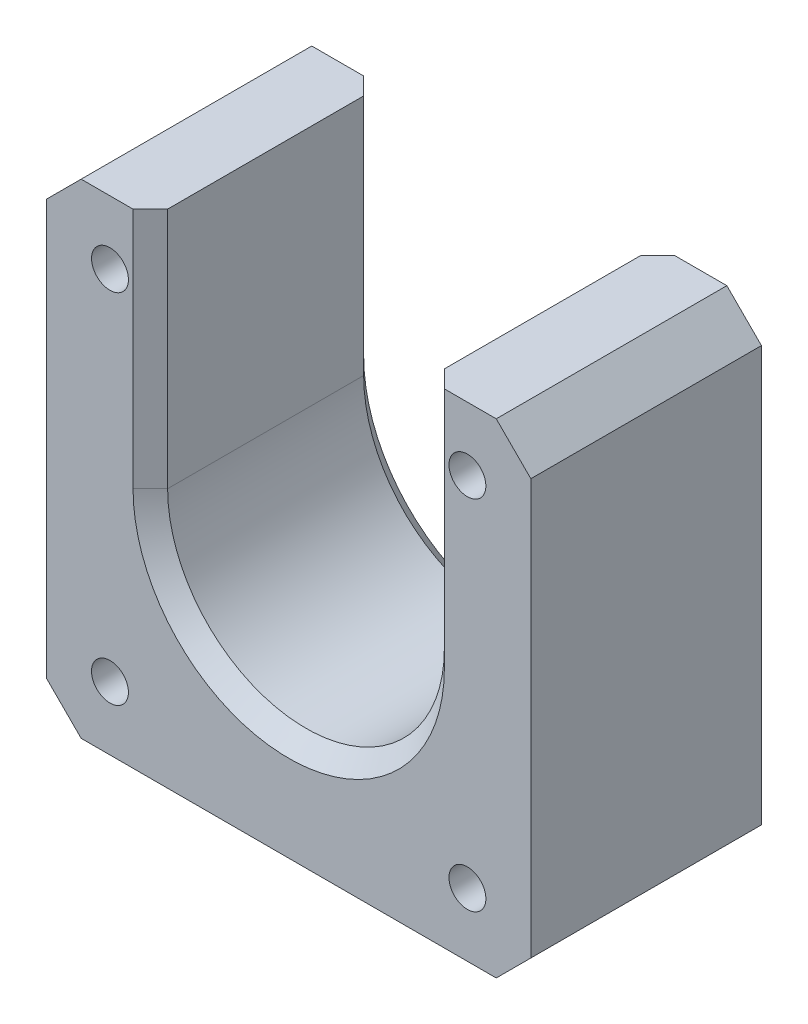
ISO-10303-21;
HEADER;
FILE_DESCRIPTION(('STEP AP214'),'2;1');
FILE_NAME('part.step','',(''),(''),'','','');
FILE_SCHEMA(('AUTOMOTIVE_DESIGN { 1 0 10303 214 1 1 1 1 }'));
ENDSEC;
DATA;
#1=APPLICATION_CONTEXT('core data for automotive mechanical design processes');
#2=APPLICATION_PROTOCOL_DEFINITION('international standard','automotive_design',2000,#1);
#3=PRODUCT_CONTEXT('',#1,'mechanical');
#4=PRODUCT('Part','Part','',(#3));
#5=PRODUCT_RELATED_PRODUCT_CATEGORY('part','',(#4));
#6=PRODUCT_DEFINITION_FORMATION('','',#4);
#7=PRODUCT_DEFINITION_CONTEXT('part definition',#1,'design');
#8=PRODUCT_DEFINITION('design','',#6,#7);
#9=PRODUCT_DEFINITION_SHAPE('','',#8);
#10=(LENGTH_UNIT() NAMED_UNIT(*) SI_UNIT(.MILLI.,.METRE.));
#11=(NAMED_UNIT(*) PLANE_ANGLE_UNIT() SI_UNIT($,.RADIAN.));
#12=(NAMED_UNIT(*) SI_UNIT($,.STERADIAN.) SOLID_ANGLE_UNIT());
#13=UNCERTAINTY_MEASURE_WITH_UNIT(LENGTH_MEASURE(1.E-05),#10,'distance_accuracy_value','');
#14=(GEOMETRIC_REPRESENTATION_CONTEXT(3) GLOBAL_UNCERTAINTY_ASSIGNED_CONTEXT((#13)) GLOBAL_UNIT_ASSIGNED_CONTEXT((#10,
#11,#12)) REPRESENTATION_CONTEXT('',''));
#15=CARTESIAN_POINT('',(0.,0.,0.));
#16=DIRECTION('',(0.,0.,1.));
#17=DIRECTION('',(1.,0.,0.));
#18=AXIS2_PLACEMENT_3D('',#15,#16,#17);
#19=CARTESIAN_POINT('',(-18.,-21.,20.));
#20=DIRECTION('',(0.707106781186547,0.707106781186548,0.));
#21=DIRECTION('',(0.,0.,-1.));
#22=AXIS2_PLACEMENT_3D('',#19,#20,#21);
#23=PLANE('',#22);
#24=DIRECTION('',(0.,0.,-1.));
#25=VECTOR('',#24,1.);
#26=CARTESIAN_POINT('',(-18.,-21.,20.));
#27=LINE('',#26,#25);
#28=CARTESIAN_POINT('',(-18.,-21.,20.));
#29=VERTEX_POINT('',#28);
#30=CARTESIAN_POINT('',(-18.,-21.,0.));
#31=VERTEX_POINT('',#30);
#32=EDGE_CURVE('E234',#29,#31,#27,.T.);
#33=ORIENTED_EDGE('',*,*,#32,.F.);
#34=DIRECTION('',(-0.707106781186548,0.707106781186547,0.));
#35=VECTOR('',#34,1.);
#36=CARTESIAN_POINT('',(-19.5,-19.5,20.));
#37=LINE('',#36,#35);
#38=CARTESIAN_POINT('',(-21.,-18.,20.));
#39=VERTEX_POINT('',#38);
#40=EDGE_CURVE('E242',#39,#29,#37,.F.);
#41=ORIENTED_EDGE('',*,*,#40,.F.);
#42=DIRECTION('',(0.,0.,1.));
#43=VECTOR('',#42,1.);
#44=CARTESIAN_POINT('',(-21.,-18.,20.));
#45=LINE('',#44,#43);
#46=CARTESIAN_POINT('',(-21.,-18.,0.));
#47=VERTEX_POINT('',#46);
#48=EDGE_CURVE('E238',#47,#39,#45,.T.);
#49=ORIENTED_EDGE('',*,*,#48,.F.);
#50=DIRECTION('',(0.707106781186548,-0.707106781186547,0.));
#51=VECTOR('',#50,1.);
#52=CARTESIAN_POINT('',(-18.,-21.,0.));
#53=LINE('',#52,#51);
#54=EDGE_CURVE('E245',#31,#47,#53,.F.);
#55=ORIENTED_EDGE('',*,*,#54,.F.);
#56=EDGE_LOOP('',(#33,#41,#49,#55));
#57=FACE_BOUND('',#56,.T.);
#58=ADVANCED_FACE('F51',(#57),#23,.F.);
#59=CARTESIAN_POINT('',(21.,-18.,20.));
#60=DIRECTION('',(-0.707106781186547,0.707106781186548,0.));
#61=DIRECTION('',(0.,0.,-1.));
#62=AXIS2_PLACEMENT_3D('',#59,#60,#61);
#63=PLANE('',#62);
#64=DIRECTION('',(0.,0.,-1.));
#65=VECTOR('',#64,1.);
#66=CARTESIAN_POINT('',(21.,-18.,20.));
#67=LINE('',#66,#65);
#68=CARTESIAN_POINT('',(21.,-18.,20.));
#69=VERTEX_POINT('',#68);
#70=CARTESIAN_POINT('',(21.,-18.,0.));
#71=VERTEX_POINT('',#70);
#72=EDGE_CURVE('E219',#69,#71,#67,.T.);
#73=ORIENTED_EDGE('',*,*,#72,.F.);
#74=DIRECTION('',(-0.707106781186548,-0.707106781186547,0.));
#75=VECTOR('',#74,1.);
#76=CARTESIAN_POINT('',(19.5,-19.5,20.));
#77=LINE('',#76,#75);
#78=CARTESIAN_POINT('',(18.,-21.,20.));
#79=VERTEX_POINT('',#78);
#80=EDGE_CURVE('E227',#79,#69,#77,.F.);
#81=ORIENTED_EDGE('',*,*,#80,.F.);
#82=DIRECTION('',(0.,0.,1.));
#83=VECTOR('',#82,1.);
#84=CARTESIAN_POINT('',(18.,-21.,20.));
#85=LINE('',#84,#83);
#86=CARTESIAN_POINT('',(18.,-21.,0.));
#87=VERTEX_POINT('',#86);
#88=EDGE_CURVE('E223',#87,#79,#85,.T.);
#89=ORIENTED_EDGE('',*,*,#88,.F.);
#90=DIRECTION('',(0.707106781186548,0.707106781186547,0.));
#91=VECTOR('',#90,1.);
#92=CARTESIAN_POINT('',(21.,-18.,0.));
#93=LINE('',#92,#91);
#94=EDGE_CURVE('E230',#71,#87,#93,.F.);
#95=ORIENTED_EDGE('',*,*,#94,.F.);
#96=EDGE_LOOP('',(#73,#81,#89,#95));
#97=FACE_BOUND('',#96,.T.);
#98=ADVANCED_FACE('F400',(#97),#63,.F.);
#99=CARTESIAN_POINT('',(18.,21.,20.));
#100=DIRECTION('',(-0.707106781186547,-0.707106781186548,0.));
#101=DIRECTION('',(0.,0.,-1.));
#102=AXIS2_PLACEMENT_3D('',#99,#100,#101);
#103=PLANE('',#102);
#104=DIRECTION('',(0.,0.,-1.));
#105=VECTOR('',#104,1.);
#106=CARTESIAN_POINT('',(18.,21.,20.));
#107=LINE('',#106,#105);
#108=CARTESIAN_POINT('',(18.,21.,20.));
#109=VERTEX_POINT('',#108);
#110=CARTESIAN_POINT('',(18.,21.,0.));
#111=VERTEX_POINT('',#110);
#112=EDGE_CURVE('E186',#109,#111,#107,.T.);
#113=ORIENTED_EDGE('',*,*,#112,.F.);
#114=DIRECTION('',(0.707106781186548,-0.707106781186547,0.));
#115=VECTOR('',#114,1.);
#116=CARTESIAN_POINT('',(19.5,19.5,20.));
#117=LINE('',#116,#115);
#118=CARTESIAN_POINT('',(21.,18.,20.));
#119=VERTEX_POINT('',#118);
#120=EDGE_CURVE('E212',#119,#109,#117,.F.);
#121=ORIENTED_EDGE('',*,*,#120,.F.);
#122=DIRECTION('',(0.,0.,1.));
#123=VECTOR('',#122,1.);
#124=CARTESIAN_POINT('',(21.,18.,20.));
#125=LINE('',#124,#123);
#126=CARTESIAN_POINT('',(21.,18.,0.));
#127=VERTEX_POINT('',#126);
#128=EDGE_CURVE('E208',#127,#119,#125,.T.);
#129=ORIENTED_EDGE('',*,*,#128,.F.);
#130=DIRECTION('',(-0.707106781186548,0.707106781186547,0.));
#131=VECTOR('',#130,1.);
#132=CARTESIAN_POINT('',(18.,21.,0.));
#133=LINE('',#132,#131);
#134=EDGE_CURVE('E215',#111,#127,#133,.F.);
#135=ORIENTED_EDGE('',*,*,#134,.F.);
#136=EDGE_LOOP('',(#113,#121,#129,#135));
#137=FACE_BOUND('',#136,.T.);
#138=ADVANCED_FACE('F406',(#137),#103,.F.);
#139=CARTESIAN_POINT('',(-18.,21.,20.));
#140=DIRECTION('',(0.707106781186547,-0.707106781186548,0.));
#141=DIRECTION('',(0.,0.,1.));
#142=AXIS2_PLACEMENT_3D('',#139,#140,#141);
#143=PLANE('',#142);
#144=DIRECTION('',(0.,0.,1.));
#145=VECTOR('',#144,1.);
#146=CARTESIAN_POINT('',(-18.,21.,20.));
#147=LINE('',#146,#145);
#148=CARTESIAN_POINT('',(-18.,21.,0.));
#149=VERTEX_POINT('',#148);
#150=CARTESIAN_POINT('',(-18.,21.,20.));
#151=VERTEX_POINT('',#150);
#152=EDGE_CURVE('E181',#149,#151,#147,.T.);
#153=ORIENTED_EDGE('',*,*,#152,.F.);
#154=DIRECTION('',(-0.707106781186548,-0.707106781186547,0.));
#155=VECTOR('',#154,1.);
#156=CARTESIAN_POINT('',(-18.,21.,0.));
#157=LINE('',#156,#155);
#158=CARTESIAN_POINT('',(-21.,18.,0.));
#159=VERTEX_POINT('',#158);
#160=EDGE_CURVE('E187',#159,#149,#157,.F.);
#161=ORIENTED_EDGE('',*,*,#160,.F.);
#162=DIRECTION('',(0.,0.,-1.));
#163=VECTOR('',#162,1.);
#164=CARTESIAN_POINT('',(-21.,18.,20.));
#165=LINE('',#164,#163);
#166=CARTESIAN_POINT('',(-21.,18.,20.));
#167=VERTEX_POINT('',#166);
#168=EDGE_CURVE('E183',#167,#159,#165,.T.);
#169=ORIENTED_EDGE('',*,*,#168,.F.);
#170=DIRECTION('',(0.707106781186548,0.707106781186547,0.));
#171=VECTOR('',#170,1.);
#172=CARTESIAN_POINT('',(-19.5,19.5,20.));
#173=LINE('',#172,#171);
#174=EDGE_CURVE('E169',#151,#167,#173,.F.);
#175=ORIENTED_EDGE('',*,*,#174,.F.);
#176=EDGE_LOOP('',(#153,#161,#169,#175));
#177=FACE_BOUND('',#176,.T.);
#178=ADVANCED_FACE('F180',(#177),#143,.F.);
#179=CARTESIAN_POINT('',(-21.,21.,20.));
#180=DIRECTION('',(0.,-1.,0.));
#181=DIRECTION('',(0.,0.,-1.));
#182=AXIS2_PLACEMENT_3D('',#179,#180,#181);
#183=PLANE('',#182);
#184=DIRECTION('',(0.,0.,1.));
#185=VECTOR('',#184,1.);
#186=CARTESIAN_POINT('',(-12.,21.,-10.));
#187=LINE('',#186,#185);
#188=CARTESIAN_POINT('',(-12.,21.,1.5));
#189=VERTEX_POINT('',#188);
#190=CARTESIAN_POINT('',(-12.,21.,18.5));
#191=VERTEX_POINT('',#190);
#192=EDGE_CURVE('E327',#189,#191,#187,.T.);
#193=ORIENTED_EDGE('',*,*,#192,.F.);
#194=DIRECTION('',(0.707106781186546,0.,0.707106781186549));
#195=VECTOR('',#194,1.);
#196=CARTESIAN_POINT('',(-13.5,21.,0.));
#197=LINE('',#196,#195);
#198=CARTESIAN_POINT('',(-13.5,21.,0.));
#199=VERTEX_POINT('',#198);
#200=EDGE_CURVE('E268',#189,#199,#197,.F.);
#201=ORIENTED_EDGE('',*,*,#200,.T.);
#202=DIRECTION('',(-1.,0.,0.));
#203=VECTOR('',#202,1.);
#204=CARTESIAN_POINT('',(-21.,21.,0.));
#205=LINE('',#204,#203);
#206=EDGE_CURVE('E192',#199,#149,#205,.T.);
#207=ORIENTED_EDGE('',*,*,#206,.T.);
#208=ORIENTED_EDGE('',*,*,#152,.T.);
#209=DIRECTION('',(-1.,0.,0.));
#210=VECTOR('',#209,1.);
#211=CARTESIAN_POINT('',(-21.,21.,20.));
#212=LINE('',#211,#210);
#213=CARTESIAN_POINT('',(-13.5,21.,20.));
#214=VERTEX_POINT('',#213);
#215=EDGE_CURVE('E164',#214,#151,#212,.T.);
#216=ORIENTED_EDGE('',*,*,#215,.F.);
#217=DIRECTION('',(0.70710678118655,0.,-0.707106781186546));
#218=VECTOR('',#217,1.);
#219=CARTESIAN_POINT('',(-12.,21.,18.5));
#220=LINE('',#219,#218);
#221=EDGE_CURVE('E265',#214,#191,#220,.T.);
#222=ORIENTED_EDGE('',*,*,#221,.T.);
#223=EDGE_LOOP('',(#193,#201,#207,#208,#216,#222));
#224=FACE_BOUND('',#223,.T.);
#225=ADVANCED_FACE('F190',(#224),#183,.F.);
#226=CARTESIAN_POINT('',(-21.,21.,20.));
#227=DIRECTION('',(1.,0.,0.));
#228=DIRECTION('',(0.,0.,-1.));
#229=AXIS2_PLACEMENT_3D('',#226,#227,#228);
#230=PLANE('',#229);
#231=DIRECTION('',(0.,-1.,0.));
#232=VECTOR('',#231,1.);
#233=CARTESIAN_POINT('',(-21.,21.,0.));
#234=LINE('',#233,#232);
#235=EDGE_CURVE('E352',#159,#47,#234,.T.);
#236=ORIENTED_EDGE('',*,*,#235,.T.);
#237=ORIENTED_EDGE('',*,*,#48,.T.);
#238=DIRECTION('',(0.,-1.,0.));
#239=VECTOR('',#238,1.);
#240=CARTESIAN_POINT('',(-21.,21.,20.));
#241=LINE('',#240,#239);
#242=EDGE_CURVE('E343',#167,#39,#241,.T.);
#243=ORIENTED_EDGE('',*,*,#242,.F.);
#244=ORIENTED_EDGE('',*,*,#168,.T.);
#245=EDGE_LOOP('',(#236,#237,#243,#244));
#246=FACE_BOUND('',#245,.T.);
#247=ADVANCED_FACE('F519',(#246),#230,.F.);
#248=CARTESIAN_POINT('',(-21.,-21.,20.));
#249=DIRECTION('',(0.,1.,0.));
#250=DIRECTION('',(0.,0.,1.));
#251=AXIS2_PLACEMENT_3D('',#248,#249,#250);
#252=PLANE('',#251);
#253=DIRECTION('',(1.,0.,0.));
#254=VECTOR('',#253,1.);
#255=CARTESIAN_POINT('',(-21.,-21.,20.));
#256=LINE('',#255,#254);
#257=EDGE_CURVE('E346',#29,#79,#256,.T.);
#258=ORIENTED_EDGE('',*,*,#257,.F.);
#259=ORIENTED_EDGE('',*,*,#32,.T.);
#260=DIRECTION('',(1.,0.,0.));
#261=VECTOR('',#260,1.);
#262=CARTESIAN_POINT('',(-21.,-21.,0.));
#263=LINE('',#262,#261);
#264=EDGE_CURVE('E356',#31,#87,#263,.T.);
#265=ORIENTED_EDGE('',*,*,#264,.T.);
#266=ORIENTED_EDGE('',*,*,#88,.T.);
#267=EDGE_LOOP('',(#258,#259,#265,#266));
#268=FACE_BOUND('',#267,.T.);
#269=ADVANCED_FACE('F526',(#268),#252,.F.);
#270=CARTESIAN_POINT('',(21.,21.,20.));
#271=DIRECTION('',(-1.,0.,0.));
#272=DIRECTION('',(0.,0.,1.));
#273=AXIS2_PLACEMENT_3D('',#270,#271,#272);
#274=PLANE('',#273);
#275=DIRECTION('',(0.,1.,0.));
#276=VECTOR('',#275,1.);
#277=CARTESIAN_POINT('',(21.,21.,20.));
#278=LINE('',#277,#276);
#279=EDGE_CURVE('E176',#69,#119,#278,.T.);
#280=ORIENTED_EDGE('',*,*,#279,.F.);
#281=ORIENTED_EDGE('',*,*,#72,.T.);
#282=DIRECTION('',(0.,1.,0.));
#283=VECTOR('',#282,1.);
#284=CARTESIAN_POINT('',(21.,21.,0.));
#285=LINE('',#284,#283);
#286=EDGE_CURVE('E359',#71,#127,#285,.T.);
#287=ORIENTED_EDGE('',*,*,#286,.T.);
#288=ORIENTED_EDGE('',*,*,#128,.T.);
#289=EDGE_LOOP('',(#280,#281,#287,#288));
#290=FACE_BOUND('',#289,.T.);
#291=ADVANCED_FACE('F509',(#290),#274,.F.);
#292=CARTESIAN_POINT('',(13.5,21.,0.));
#293=VERTEX_POINT('',#292);
#294=EDGE_CURVE('E347',#111,#293,#205,.T.);
#295=ORIENTED_EDGE('',*,*,#294,.T.);
#296=DIRECTION('',(0.707106781186546,0.,-0.707106781186549));
#297=VECTOR('',#296,1.);
#298=CARTESIAN_POINT('',(13.5,21.,0.));
#299=LINE('',#298,#297);
#300=CARTESIAN_POINT('',(12.,21.,1.5));
#301=VERTEX_POINT('',#300);
#302=EDGE_CURVE('E274',#293,#301,#299,.F.);
#303=ORIENTED_EDGE('',*,*,#302,.T.);
#304=DIRECTION('',(0.,0.,1.));
#305=VECTOR('',#304,1.);
#306=CARTESIAN_POINT('',(12.,21.,-10.));
#307=LINE('',#306,#305);
#308=CARTESIAN_POINT('',(12.,21.,18.5));
#309=VERTEX_POINT('',#308);
#310=EDGE_CURVE('E318',#301,#309,#307,.T.);
#311=ORIENTED_EDGE('',*,*,#310,.T.);
#312=DIRECTION('',(0.70710678118655,0.,0.707106781186546));
#313=VECTOR('',#312,1.);
#314=CARTESIAN_POINT('',(12.,21.,18.5));
#315=LINE('',#314,#313);
#316=CARTESIAN_POINT('',(13.5,21.,20.));
#317=VERTEX_POINT('',#316);
#318=EDGE_CURVE('E271',#309,#317,#315,.T.);
#319=ORIENTED_EDGE('',*,*,#318,.T.);
#320=EDGE_CURVE('E175',#109,#317,#212,.T.);
#321=ORIENTED_EDGE('',*,*,#320,.F.);
#322=ORIENTED_EDGE('',*,*,#112,.T.);
#323=EDGE_LOOP('',(#295,#303,#311,#319,#321,#322));
#324=FACE_BOUND('',#323,.T.);
#325=ADVANCED_FACE('F323',(#324),#183,.F.);
#326=CARTESIAN_POINT('',(0.,0.,20.));
#327=DIRECTION('',(0.,0.,1.));
#328=DIRECTION('',(1.,0.,0.));
#329=AXIS2_PLACEMENT_3D('',#326,#327,#328);
#330=PLANE('',#329);
#331=CARTESIAN_POINT('',(0.,0.,20.));
#332=DIRECTION('',(0.,0.,1.));
#333=DIRECTION('',(1.,0.,0.));
#334=AXIS2_PLACEMENT_3D('',#331,#332,#333);
#335=CIRCLE('',#334,13.5);
#336=CARTESIAN_POINT('',(13.5,0.,20.));
#337=VERTEX_POINT('',#336);
#338=CARTESIAN_POINT('',(-13.5,0.,20.));
#339=VERTEX_POINT('',#338);
#340=EDGE_CURVE('E69',#337,#339,#335,.F.);
#341=ORIENTED_EDGE('',*,*,#340,.T.);
#342=DIRECTION('',(0.,1.,0.));
#343=VECTOR('',#342,1.);
#344=CARTESIAN_POINT('',(-13.5,21.,20.));
#345=LINE('',#344,#343);
#346=EDGE_CURVE('E13',#339,#214,#345,.T.);
#347=ORIENTED_EDGE('',*,*,#346,.T.);
#348=ORIENTED_EDGE('',*,*,#215,.T.);
#349=ORIENTED_EDGE('',*,*,#174,.T.);
#350=ORIENTED_EDGE('',*,*,#242,.T.);
#351=ORIENTED_EDGE('',*,*,#40,.T.);
#352=ORIENTED_EDGE('',*,*,#257,.T.);
#353=ORIENTED_EDGE('',*,*,#80,.T.);
#354=ORIENTED_EDGE('',*,*,#279,.T.);
#355=ORIENTED_EDGE('',*,*,#120,.T.);
#356=ORIENTED_EDGE('',*,*,#320,.T.);
#357=DIRECTION('',(0.,-1.,0.));
#358=VECTOR('',#357,1.);
#359=CARTESIAN_POINT('',(13.5,0.,20.));
#360=LINE('',#359,#358);
#361=EDGE_CURVE('E62',#317,#337,#360,.T.);
#362=ORIENTED_EDGE('',*,*,#361,.T.);
#363=EDGE_LOOP('',(#341,#347,#348,#349,#350,#351,#352,#353,#354,#355,#356,#362));
#364=FACE_BOUND('',#363,.T.);
#365=CARTESIAN_POINT('',(-15.5,-15.5,20.));
#366=DIRECTION('',(0.,0.,1.));
#367=DIRECTION('',(1.,0.,0.));
#368=AXIS2_PLACEMENT_3D('',#365,#366,#367);
#369=CIRCLE('',#368,1.6);
#370=CARTESIAN_POINT('',(-13.9,-15.5,20.));
#371=VERTEX_POINT('',#370);
#372=EDGE_CURVE('E624',#371,#371,#369,.T.);
#373=ORIENTED_EDGE('',*,*,#372,.F.);
#374=EDGE_LOOP('',(#373));
#375=FACE_BOUND('',#374,.T.);
#376=CARTESIAN_POINT('',(15.5,15.5,20.));
#377=DIRECTION('',(0.,0.,1.));
#378=DIRECTION('',(1.,0.,0.));
#379=AXIS2_PLACEMENT_3D('',#376,#377,#378);
#380=CIRCLE('',#379,1.6);
#381=CARTESIAN_POINT('',(17.1,15.5,20.));
#382=VERTEX_POINT('',#381);
#383=EDGE_CURVE('E620',#382,#382,#380,.T.);
#384=ORIENTED_EDGE('',*,*,#383,.F.);
#385=EDGE_LOOP('',(#384));
#386=FACE_BOUND('',#385,.T.);
#387=CARTESIAN_POINT('',(15.5,-15.5,20.));
#388=DIRECTION('',(0.,0.,1.));
#389=DIRECTION('',(1.,0.,0.));
#390=AXIS2_PLACEMENT_3D('',#387,#388,#389);
#391=CIRCLE('',#390,1.6);
#392=CARTESIAN_POINT('',(17.1,-15.5,20.));
#393=VERTEX_POINT('',#392);
#394=EDGE_CURVE('E342',#393,#393,#391,.T.);
#395=ORIENTED_EDGE('',*,*,#394,.F.);
#396=EDGE_LOOP('',(#395));
#397=FACE_BOUND('',#396,.T.);
#398=CARTESIAN_POINT('',(-15.5,15.5,20.));
#399=DIRECTION('',(0.,0.,1.));
#400=DIRECTION('',(1.,0.,0.));
#401=AXIS2_PLACEMENT_3D('',#398,#399,#400);
#402=CIRCLE('',#401,1.6);
#403=CARTESIAN_POINT('',(-13.9,15.5,20.));
#404=VERTEX_POINT('',#403);
#405=EDGE_CURVE('E337',#404,#404,#402,.T.);
#406=ORIENTED_EDGE('',*,*,#405,.F.);
#407=EDGE_LOOP('',(#406));
#408=FACE_BOUND('',#407,.T.);
#409=ADVANCED_FACE('F166',(#364,#375,#386,#397,#408),#330,.T.);
#410=CARTESIAN_POINT('',(0.,0.,0.));
#411=DIRECTION('',(0.,0.,1.));
#412=DIRECTION('',(1.,0.,0.));
#413=AXIS2_PLACEMENT_3D('',#410,#411,#412);
#414=PLANE('',#413);
#415=ORIENTED_EDGE('',*,*,#206,.F.);
#416=DIRECTION('',(0.,-1.,0.));
#417=VECTOR('',#416,1.);
#418=CARTESIAN_POINT('',(-13.5,0.,0.));
#419=LINE('',#418,#417);
#420=CARTESIAN_POINT('',(-13.5,0.,0.));
#421=VERTEX_POINT('',#420);
#422=EDGE_CURVE('E254',#199,#421,#419,.T.);
#423=ORIENTED_EDGE('',*,*,#422,.T.);
#424=CARTESIAN_POINT('',(0.,0.,0.));
#425=DIRECTION('',(0.,0.,1.));
#426=DIRECTION('',(1.,0.,0.));
#427=AXIS2_PLACEMENT_3D('',#424,#425,#426);
#428=CIRCLE('',#427,13.5);
#429=CARTESIAN_POINT('',(13.5,0.,0.));
#430=VERTEX_POINT('',#429);
#431=EDGE_CURVE('E248',#421,#430,#428,.T.);
#432=ORIENTED_EDGE('',*,*,#431,.T.);
#433=DIRECTION('',(0.,1.,0.));
#434=VECTOR('',#433,1.);
#435=CARTESIAN_POINT('',(13.5,0.,0.));
#436=LINE('',#435,#434);
#437=EDGE_CURVE('E251',#430,#293,#436,.T.);
#438=ORIENTED_EDGE('',*,*,#437,.T.);
#439=ORIENTED_EDGE('',*,*,#294,.F.);
#440=ORIENTED_EDGE('',*,*,#134,.T.);
#441=ORIENTED_EDGE('',*,*,#286,.F.);
#442=ORIENTED_EDGE('',*,*,#94,.T.);
#443=ORIENTED_EDGE('',*,*,#264,.F.);
#444=ORIENTED_EDGE('',*,*,#54,.T.);
#445=ORIENTED_EDGE('',*,*,#235,.F.);
#446=ORIENTED_EDGE('',*,*,#160,.T.);
#447=EDGE_LOOP('',(#415,#423,#432,#438,#439,#440,#441,#442,#443,#444,#445,#446));
#448=FACE_BOUND('',#447,.T.);
#449=CARTESIAN_POINT('',(-15.5,-15.5,0.));
#450=DIRECTION('',(0.,0.,1.));
#451=DIRECTION('',(1.,0.,0.));
#452=AXIS2_PLACEMENT_3D('',#449,#450,#451);
#453=CIRCLE('',#452,1.6);
#454=CARTESIAN_POINT('',(-13.9,-15.5,0.));
#455=VERTEX_POINT('',#454);
#456=EDGE_CURVE('E200',#455,#455,#453,.T.);
#457=ORIENTED_EDGE('',*,*,#456,.T.);
#458=EDGE_LOOP('',(#457));
#459=FACE_BOUND('',#458,.T.);
#460=CARTESIAN_POINT('',(15.5,15.5,0.));
#461=DIRECTION('',(0.,0.,1.));
#462=DIRECTION('',(1.,0.,0.));
#463=AXIS2_PLACEMENT_3D('',#460,#461,#462);
#464=CIRCLE('',#463,1.6);
#465=CARTESIAN_POINT('',(17.1,15.5,0.));
#466=VERTEX_POINT('',#465);
#467=EDGE_CURVE('E370',#466,#466,#464,.T.);
#468=ORIENTED_EDGE('',*,*,#467,.T.);
#469=EDGE_LOOP('',(#468));
#470=FACE_BOUND('',#469,.T.);
#471=CARTESIAN_POINT('',(15.5,-15.5,0.));
#472=DIRECTION('',(0.,0.,1.));
#473=DIRECTION('',(1.,0.,0.));
#474=AXIS2_PLACEMENT_3D('',#471,#472,#473);
#475=CIRCLE('',#474,1.6);
#476=CARTESIAN_POINT('',(17.1,-15.5,0.));
#477=VERTEX_POINT('',#476);
#478=EDGE_CURVE('E367',#477,#477,#475,.T.);
#479=ORIENTED_EDGE('',*,*,#478,.T.);
#480=EDGE_LOOP('',(#479));
#481=FACE_BOUND('',#480,.T.);
#482=CARTESIAN_POINT('',(-15.5,15.5,0.));
#483=DIRECTION('',(0.,0.,1.));
#484=DIRECTION('',(1.,0.,0.));
#485=AXIS2_PLACEMENT_3D('',#482,#483,#484);
#486=CIRCLE('',#485,1.6);
#487=CARTESIAN_POINT('',(-13.9,15.5,0.));
#488=VERTEX_POINT('',#487);
#489=EDGE_CURVE('E341',#488,#488,#486,.T.);
#490=ORIENTED_EDGE('',*,*,#489,.T.);
#491=EDGE_LOOP('',(#490));
#492=FACE_BOUND('',#491,.T.);
#493=ADVANCED_FACE('F379',(#448,#459,#470,#481,#492),#414,.F.);
#494=CARTESIAN_POINT('',(-15.5,15.5,-10.));
#495=DIRECTION('',(0.,0.,1.));
#496=DIRECTION('',(1.,0.,0.));
#497=AXIS2_PLACEMENT_3D('',#494,#495,#496);
#498=CYLINDRICAL_SURFACE('',#497,1.6);
#499=ORIENTED_EDGE('',*,*,#405,.T.);
#500=EDGE_LOOP('',(#499));
#501=FACE_BOUND('',#500,.T.);
#502=ORIENTED_EDGE('',*,*,#489,.F.);
#503=EDGE_LOOP('',(#502));
#504=FACE_BOUND('',#503,.T.);
#505=ADVANCED_FACE('F489',(#501,#504),#498,.F.);
#506=CARTESIAN_POINT('',(15.5,-15.5,-10.));
#507=DIRECTION('',(0.,0.,1.));
#508=DIRECTION('',(1.,0.,0.));
#509=AXIS2_PLACEMENT_3D('',#506,#507,#508);
#510=CYLINDRICAL_SURFACE('',#509,1.6);
#511=ORIENTED_EDGE('',*,*,#394,.T.);
#512=EDGE_LOOP('',(#511));
#513=FACE_BOUND('',#512,.T.);
#514=ORIENTED_EDGE('',*,*,#478,.F.);
#515=EDGE_LOOP('',(#514));
#516=FACE_BOUND('',#515,.T.);
#517=ADVANCED_FACE('F394',(#513,#516),#510,.F.);
#518=CARTESIAN_POINT('',(15.5,15.5,-10.));
#519=DIRECTION('',(0.,0.,1.));
#520=DIRECTION('',(1.,0.,0.));
#521=AXIS2_PLACEMENT_3D('',#518,#519,#520);
#522=CYLINDRICAL_SURFACE('',#521,1.6);
#523=ORIENTED_EDGE('',*,*,#383,.T.);
#524=EDGE_LOOP('',(#523));
#525=FACE_BOUND('',#524,.T.);
#526=ORIENTED_EDGE('',*,*,#467,.F.);
#527=EDGE_LOOP('',(#526));
#528=FACE_BOUND('',#527,.T.);
#529=ADVANCED_FACE('F384',(#525,#528),#522,.F.);
#530=CARTESIAN_POINT('',(-15.5,-15.5,-10.));
#531=DIRECTION('',(0.,0.,1.));
#532=DIRECTION('',(1.,0.,0.));
#533=AXIS2_PLACEMENT_3D('',#530,#531,#532);
#534=CYLINDRICAL_SURFACE('',#533,1.6);
#535=ORIENTED_EDGE('',*,*,#372,.T.);
#536=EDGE_LOOP('',(#535));
#537=FACE_BOUND('',#536,.T.);
#538=ORIENTED_EDGE('',*,*,#456,.F.);
#539=EDGE_LOOP('',(#538));
#540=FACE_BOUND('',#539,.T.);
#541=ADVANCED_FACE('F381',(#537,#540),#534,.F.);
#542=CARTESIAN_POINT('',(0.,0.,-10.));
#543=DIRECTION('',(0.,0.,1.));
#544=DIRECTION('',(1.,0.,0.));
#545=AXIS2_PLACEMENT_3D('',#542,#543,#544);
#546=CYLINDRICAL_SURFACE('',#545,12.);
#547=DIRECTION('',(0.,0.,1.));
#548=VECTOR('',#547,1.);
#549=CARTESIAN_POINT('',(12.,0.,-10.));
#550=LINE('',#549,#548);
#551=CARTESIAN_POINT('',(12.,0.,1.5));
#552=VERTEX_POINT('',#551);
#553=CARTESIAN_POINT('',(12.,0.,18.5));
#554=VERTEX_POINT('',#553);
#555=EDGE_CURVE('E299',#552,#554,#550,.T.);
#556=ORIENTED_EDGE('',*,*,#555,.F.);
#557=CARTESIAN_POINT('',(0.,0.,1.5));
#558=DIRECTION('',(0.,0.,1.));
#559=DIRECTION('',(1.,0.,0.));
#560=AXIS2_PLACEMENT_3D('',#557,#558,#559);
#561=CIRCLE('',#560,12.);
#562=CARTESIAN_POINT('',(-12.,0.,1.5));
#563=VERTEX_POINT('',#562);
#564=EDGE_CURVE('E286',#552,#563,#561,.F.);
#565=ORIENTED_EDGE('',*,*,#564,.T.);
#566=DIRECTION('',(0.,0.,1.));
#567=VECTOR('',#566,1.);
#568=CARTESIAN_POINT('',(-12.,0.,-10.));
#569=LINE('',#568,#567);
#570=CARTESIAN_POINT('',(-12.,0.,18.5));
#571=VERTEX_POINT('',#570);
#572=EDGE_CURVE('E332',#563,#571,#569,.T.);
#573=ORIENTED_EDGE('',*,*,#572,.T.);
#574=CARTESIAN_POINT('',(0.,0.,18.5));
#575=DIRECTION('',(0.,0.,1.));
#576=DIRECTION('',(1.,0.,0.));
#577=AXIS2_PLACEMENT_3D('',#574,#575,#576);
#578=CIRCLE('',#577,12.);
#579=EDGE_CURVE('E283',#571,#554,#578,.T.);
#580=ORIENTED_EDGE('',*,*,#579,.T.);
#581=EDGE_LOOP('',(#556,#565,#573,#580));
#582=FACE_BOUND('',#581,.T.);
#583=ADVANCED_FACE('F383',(#582),#546,.F.);
#584=CARTESIAN_POINT('',(-12.,0.,-10.));
#585=DIRECTION('',(-1.,0.,0.));
#586=DIRECTION('',(0.,-1.,0.));
#587=AXIS2_PLACEMENT_3D('',#584,#585,#586);
#588=PLANE('',#587);
#589=ORIENTED_EDGE('',*,*,#572,.F.);
#590=DIRECTION('',(0.,1.,0.));
#591=VECTOR('',#590,1.);
#592=CARTESIAN_POINT('',(-12.,0.,1.5));
#593=LINE('',#592,#591);
#594=EDGE_CURVE('E262',#563,#189,#593,.T.);
#595=ORIENTED_EDGE('',*,*,#594,.T.);
#596=ORIENTED_EDGE('',*,*,#192,.T.);
#597=DIRECTION('',(0.,-1.,0.));
#598=VECTOR('',#597,1.);
#599=CARTESIAN_POINT('',(-12.,0.,18.5));
#600=LINE('',#599,#598);
#601=EDGE_CURVE('E258',#191,#571,#600,.T.);
#602=ORIENTED_EDGE('',*,*,#601,.T.);
#603=EDGE_LOOP('',(#589,#595,#596,#602));
#604=FACE_BOUND('',#603,.T.);
#605=ADVANCED_FACE('F391',(#604),#588,.F.);
#606=CARTESIAN_POINT('',(12.,21.,-10.));
#607=DIRECTION('',(1.,0.,0.));
#608=DIRECTION('',(0.,0.,-1.));
#609=AXIS2_PLACEMENT_3D('',#606,#607,#608);
#610=PLANE('',#609);
#611=ORIENTED_EDGE('',*,*,#310,.F.);
#612=DIRECTION('',(0.,-1.,0.));
#613=VECTOR('',#612,1.);
#614=CARTESIAN_POINT('',(12.,21.,1.5));
#615=LINE('',#614,#613);
#616=EDGE_CURVE('E280',#301,#552,#615,.T.);
#617=ORIENTED_EDGE('',*,*,#616,.T.);
#618=ORIENTED_EDGE('',*,*,#555,.T.);
#619=DIRECTION('',(0.,1.,0.));
#620=VECTOR('',#619,1.);
#621=CARTESIAN_POINT('',(12.,21.,18.5));
#622=LINE('',#621,#620);
#623=EDGE_CURVE('E277',#554,#309,#622,.T.);
#624=ORIENTED_EDGE('',*,*,#623,.T.);
#625=EDGE_LOOP('',(#611,#617,#618,#624));
#626=FACE_BOUND('',#625,.T.);
#627=ADVANCED_FACE('F317',(#626),#610,.F.);
#628=CARTESIAN_POINT('',(13.5,0.,0.));
#629=DIRECTION('',(0.707106781186549,0.,0.707106781186546));
#630=DIRECTION('',(0.,1.,0.));
#631=AXIS2_PLACEMENT_3D('',#628,#629,#630);
#632=PLANE('',#631);
#633=ORIENTED_EDGE('',*,*,#302,.F.);
#634=ORIENTED_EDGE('',*,*,#437,.F.);
#635=DIRECTION('',(0.707106781186546,0.,-0.707106781186549));
#636=VECTOR('',#635,1.);
#637=CARTESIAN_POINT('',(12.,0.,1.5));
#638=LINE('',#637,#636);
#639=EDGE_CURVE('E296',#552,#430,#638,.T.);
#640=ORIENTED_EDGE('',*,*,#639,.F.);
#641=ORIENTED_EDGE('',*,*,#616,.F.);
#642=EDGE_LOOP('',(#633,#634,#640,#641));
#643=FACE_BOUND('',#642,.T.);
#644=ADVANCED_FACE('F430',(#643),#632,.F.);
#645=CARTESIAN_POINT('',(0.,0.,0.));
#646=DIRECTION('',(0.,0.,-1.));
#647=DIRECTION('',(-1.,0.,0.));
#648=AXIS2_PLACEMENT_3D('',#645,#646,#647);
#649=CONICAL_SURFACE('',#648,13.5,0.785398163397446);
#650=ORIENTED_EDGE('',*,*,#639,.T.);
#651=ORIENTED_EDGE('',*,*,#431,.F.);
#652=DIRECTION('',(-0.707106781186546,0.,-0.707106781186549));
#653=VECTOR('',#652,1.);
#654=CARTESIAN_POINT('',(-12.,0.,1.5));
#655=LINE('',#654,#653);
#656=EDGE_CURVE('E293',#563,#421,#655,.T.);
#657=ORIENTED_EDGE('',*,*,#656,.F.);
#658=ORIENTED_EDGE('',*,*,#564,.F.);
#659=EDGE_LOOP('',(#650,#651,#657,#658));
#660=FACE_BOUND('',#659,.T.);
#661=ADVANCED_FACE('F424',(#660),#649,.F.);
#662=CARTESIAN_POINT('',(-13.5,0.,0.));
#663=DIRECTION('',(-0.707106781186549,0.,0.707106781186546));
#664=DIRECTION('',(0.,-1.,0.));
#665=AXIS2_PLACEMENT_3D('',#662,#663,#664);
#666=PLANE('',#665);
#667=ORIENTED_EDGE('',*,*,#200,.F.);
#668=ORIENTED_EDGE('',*,*,#594,.F.);
#669=ORIENTED_EDGE('',*,*,#656,.T.);
#670=ORIENTED_EDGE('',*,*,#422,.F.);
#671=EDGE_LOOP('',(#667,#668,#669,#670));
#672=FACE_BOUND('',#671,.T.);
#673=ADVANCED_FACE('F418',(#672),#666,.F.);
#674=CARTESIAN_POINT('',(12.,21.,18.5));
#675=DIRECTION('',(-0.707106781186546,0.,0.70710678118655));
#676=DIRECTION('',(0.,-1.,0.));
#677=AXIS2_PLACEMENT_3D('',#674,#675,#676);
#678=PLANE('',#677);
#679=ORIENTED_EDGE('',*,*,#318,.F.);
#680=ORIENTED_EDGE('',*,*,#623,.F.);
#681=DIRECTION('',(-0.70710678118655,0.,-0.707106781186546));
#682=VECTOR('',#681,1.);
#683=CARTESIAN_POINT('',(13.5,0.,20.));
#684=LINE('',#683,#682);
#685=EDGE_CURVE('E56',#337,#554,#684,.T.);
#686=ORIENTED_EDGE('',*,*,#685,.F.);
#687=ORIENTED_EDGE('',*,*,#361,.F.);
#688=EDGE_LOOP('',(#679,#680,#686,#687));
#689=FACE_BOUND('',#688,.T.);
#690=ADVANCED_FACE('F54',(#689),#678,.T.);
#691=CARTESIAN_POINT('',(0.,0.,18.5));
#692=DIRECTION('',(0.,0.,1.));
#693=DIRECTION('',(1.,0.,0.));
#694=AXIS2_PLACEMENT_3D('',#691,#692,#693);
#695=CONICAL_SURFACE('',#694,12.,0.785398163397451);
#696=ORIENTED_EDGE('',*,*,#685,.T.);
#697=ORIENTED_EDGE('',*,*,#579,.F.);
#698=DIRECTION('',(0.70710678118655,0.,-0.707106781186546));
#699=VECTOR('',#698,1.);
#700=CARTESIAN_POINT('',(-13.5,0.,20.));
#701=LINE('',#700,#699);
#702=EDGE_CURVE('E300',#339,#571,#701,.T.);
#703=ORIENTED_EDGE('',*,*,#702,.F.);
#704=ORIENTED_EDGE('',*,*,#340,.F.);
#705=EDGE_LOOP('',(#696,#697,#703,#704));
#706=FACE_BOUND('',#705,.T.);
#707=ADVANCED_FACE('F309',(#706),#695,.F.);
#708=CARTESIAN_POINT('',(-12.,0.,18.5));
#709=DIRECTION('',(0.707106781186546,0.,0.70710678118655));
#710=DIRECTION('',(0.,1.,0.));
#711=AXIS2_PLACEMENT_3D('',#708,#709,#710);
#712=PLANE('',#711);
#713=ORIENTED_EDGE('',*,*,#221,.F.);
#714=ORIENTED_EDGE('',*,*,#346,.F.);
#715=ORIENTED_EDGE('',*,*,#702,.T.);
#716=ORIENTED_EDGE('',*,*,#601,.F.);
#717=EDGE_LOOP('',(#713,#714,#715,#716));
#718=FACE_BOUND('',#717,.T.);
#719=ADVANCED_FACE('F438',(#718),#712,.T.);
#720=CLOSED_SHELL('',(#58,#98,#138,#178,#225,#247,#269,#291,#325,#409,#493,#505,#517,#529,#541,
#583,#605,#627,#644,#661,#673,#690,#707,#719));
#721=MANIFOLD_SOLID_BREP('B2',#720);
#722=ADVANCED_BREP_SHAPE_REPRESENTATION('',(#18,#721),#14);
#723=SHAPE_DEFINITION_REPRESENTATION(#9,#722);
ENDSEC;
END-ISO-10303-21;
